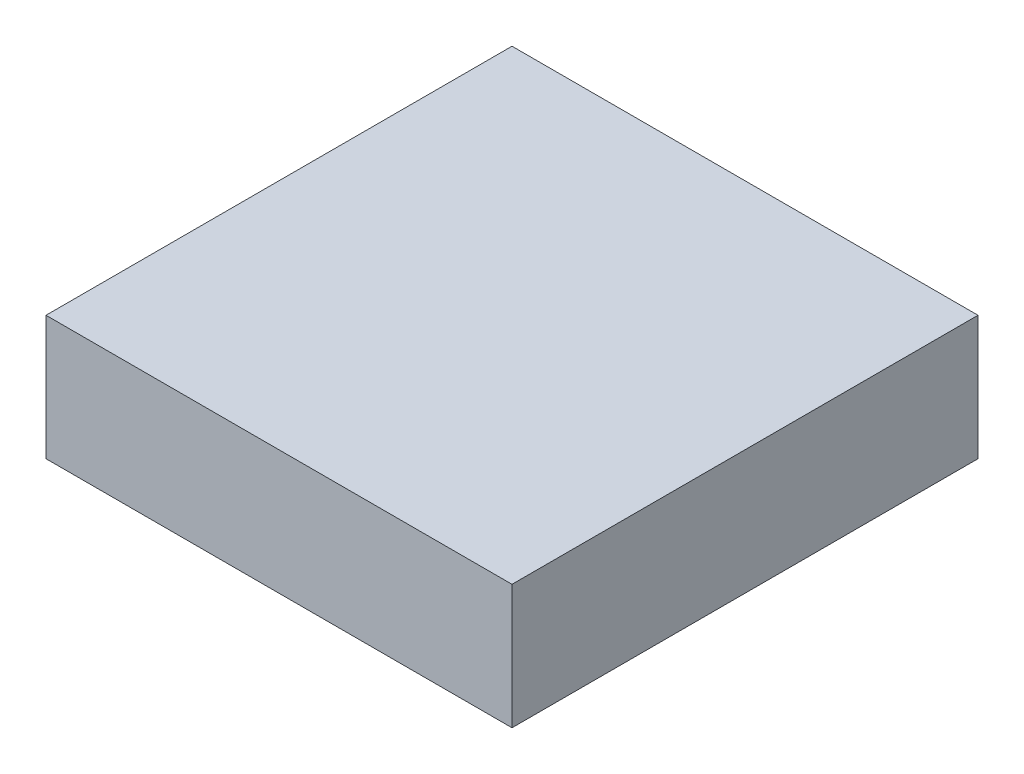
ISO-10303-21;
HEADER;
FILE_DESCRIPTION(('STEP AP214'),'2;1');
FILE_NAME('part.step','',(''),(''),'','','');
FILE_SCHEMA(('AUTOMOTIVE_DESIGN { 1 0 10303 214 1 1 1 1 }'));
ENDSEC;
DATA;
#1=APPLICATION_CONTEXT('core data for automotive mechanical design processes');
#2=APPLICATION_PROTOCOL_DEFINITION('international standard','automotive_design',2000,#1);
#3=PRODUCT_CONTEXT('',#1,'mechanical');
#4=PRODUCT('Part','Part','',(#3));
#5=PRODUCT_RELATED_PRODUCT_CATEGORY('part','',(#4));
#6=PRODUCT_DEFINITION_FORMATION('','',#4);
#7=PRODUCT_DEFINITION_CONTEXT('part definition',#1,'design');
#8=PRODUCT_DEFINITION('design','',#6,#7);
#9=PRODUCT_DEFINITION_SHAPE('','',#8);
#10=(LENGTH_UNIT() NAMED_UNIT(*) SI_UNIT(.MILLI.,.METRE.));
#11=(NAMED_UNIT(*) PLANE_ANGLE_UNIT() SI_UNIT($,.RADIAN.));
#12=(NAMED_UNIT(*) SI_UNIT($,.STERADIAN.) SOLID_ANGLE_UNIT());
#13=UNCERTAINTY_MEASURE_WITH_UNIT(LENGTH_MEASURE(1.E-05),#10,'distance_accuracy_value','');
#14=(GEOMETRIC_REPRESENTATION_CONTEXT(3) GLOBAL_UNCERTAINTY_ASSIGNED_CONTEXT((#13)) GLOBAL_UNIT_ASSIGNED_CONTEXT((#10,
#11,#12)) REPRESENTATION_CONTEXT('',''));
#15=CARTESIAN_POINT('',(0.,0.,0.));
#16=DIRECTION('',(0.,0.,1.));
#17=DIRECTION('',(1.,0.,0.));
#18=AXIS2_PLACEMENT_3D('',#15,#16,#17);
#19=CARTESIAN_POINT('',(-38.1,20.3199999999999,-38.1));
#20=DIRECTION('',(0.,0.,-1.));
#21=DIRECTION('',(-1.,0.,0.));
#22=AXIS2_PLACEMENT_3D('',#19,#20,#21);
#23=PLANE('',#22);
#24=DIRECTION('',(1.,0.,0.));
#25=VECTOR('',#24,1.);
#26=CARTESIAN_POINT('',(-38.1,0.,-38.1));
#27=LINE('',#26,#25);
#28=CARTESIAN_POINT('',(-38.1,0.,-38.1));
#29=VERTEX_POINT('',#28);
#30=CARTESIAN_POINT('',(38.1,0.,-38.1));
#31=VERTEX_POINT('',#30);
#32=EDGE_CURVE('E161',#29,#31,#27,.T.);
#33=ORIENTED_EDGE('',*,*,#32,.F.);
#34=DIRECTION('',(0.,-1.,0.));
#35=VECTOR('',#34,1.);
#36=CARTESIAN_POINT('',(-38.1,20.3199999999999,-38.1));
#37=LINE('',#36,#35);
#38=CARTESIAN_POINT('',(-38.1,20.3199999999999,-38.1));
#39=VERTEX_POINT('',#38);
#40=EDGE_CURVE('E104',#39,#29,#37,.T.);
#41=ORIENTED_EDGE('',*,*,#40,.F.);
#42=DIRECTION('',(1.,0.,0.));
#43=VECTOR('',#42,1.);
#44=CARTESIAN_POINT('',(-38.1,20.3199999999999,-38.1));
#45=LINE('',#44,#43);
#46=CARTESIAN_POINT('',(38.1,20.3199999999999,-38.1));
#47=VERTEX_POINT('',#46);
#48=EDGE_CURVE('E154',#39,#47,#45,.T.);
#49=ORIENTED_EDGE('',*,*,#48,.T.);
#50=DIRECTION('',(0.,-1.,0.));
#51=VECTOR('',#50,1.);
#52=CARTESIAN_POINT('',(38.1,20.3199999999999,-38.1));
#53=LINE('',#52,#51);
#54=EDGE_CURVE('E129',#47,#31,#53,.T.);
#55=ORIENTED_EDGE('',*,*,#54,.T.);
#56=EDGE_LOOP('',(#33,#41,#49,#55));
#57=FACE_BOUND('',#56,.T.);
#58=ADVANCED_FACE('F46',(#57),#23,.T.);
#59=CARTESIAN_POINT('',(-38.1,20.3199999999999,-38.1));
#60=DIRECTION('',(1.,0.,0.));
#61=DIRECTION('',(0.,0.,-1.));
#62=AXIS2_PLACEMENT_3D('',#59,#60,#61);
#63=PLANE('',#62);
#64=DIRECTION('',(0.,0.,1.));
#65=VECTOR('',#64,1.);
#66=CARTESIAN_POINT('',(-38.1,0.,-38.1));
#67=LINE('',#66,#65);
#68=CARTESIAN_POINT('',(-38.1,0.,38.1));
#69=VERTEX_POINT('',#68);
#70=EDGE_CURVE('E121',#29,#69,#67,.T.);
#71=ORIENTED_EDGE('',*,*,#70,.T.);
#72=DIRECTION('',(0.,-1.,0.));
#73=VECTOR('',#72,1.);
#74=CARTESIAN_POINT('',(-38.1,20.3199999999999,38.1));
#75=LINE('',#74,#73);
#76=CARTESIAN_POINT('',(-38.1,20.3199999999999,38.1));
#77=VERTEX_POINT('',#76);
#78=EDGE_CURVE('E150',#77,#69,#75,.T.);
#79=ORIENTED_EDGE('',*,*,#78,.F.);
#80=DIRECTION('',(0.,0.,1.));
#81=VECTOR('',#80,1.);
#82=CARTESIAN_POINT('',(-38.1,20.3199999999999,-38.1));
#83=LINE('',#82,#81);
#84=EDGE_CURVE('E139',#39,#77,#83,.T.);
#85=ORIENTED_EDGE('',*,*,#84,.F.);
#86=ORIENTED_EDGE('',*,*,#40,.T.);
#87=EDGE_LOOP('',(#71,#79,#85,#86));
#88=FACE_BOUND('',#87,.T.);
#89=ADVANCED_FACE('F307',(#88),#63,.F.);
#90=CARTESIAN_POINT('',(-38.1,20.3199999999999,38.1));
#91=DIRECTION('',(0.,0.,-1.));
#92=DIRECTION('',(-1.,0.,0.));
#93=AXIS2_PLACEMENT_3D('',#90,#91,#92);
#94=PLANE('',#93);
#95=DIRECTION('',(1.,0.,0.));
#96=VECTOR('',#95,1.);
#97=CARTESIAN_POINT('',(-38.1,0.,38.1));
#98=LINE('',#97,#96);
#99=CARTESIAN_POINT('',(38.1,0.,38.1));
#100=VERTEX_POINT('',#99);
#101=EDGE_CURVE('E147',#69,#100,#98,.T.);
#102=ORIENTED_EDGE('',*,*,#101,.T.);
#103=DIRECTION('',(0.,-1.,0.));
#104=VECTOR('',#103,1.);
#105=CARTESIAN_POINT('',(38.1,20.3199999999999,38.1));
#106=LINE('',#105,#104);
#107=CARTESIAN_POINT('',(38.1,20.3199999999999,38.1));
#108=VERTEX_POINT('',#107);
#109=EDGE_CURVE('E144',#108,#100,#106,.T.);
#110=ORIENTED_EDGE('',*,*,#109,.F.);
#111=DIRECTION('',(1.,0.,0.));
#112=VECTOR('',#111,1.);
#113=CARTESIAN_POINT('',(-38.1,20.3199999999999,38.1));
#114=LINE('',#113,#112);
#115=EDGE_CURVE('E134',#77,#108,#114,.T.);
#116=ORIENTED_EDGE('',*,*,#115,.F.);
#117=ORIENTED_EDGE('',*,*,#78,.T.);
#118=EDGE_LOOP('',(#102,#110,#116,#117));
#119=FACE_BOUND('',#118,.T.);
#120=ADVANCED_FACE('F145',(#119),#94,.F.);
#121=CARTESIAN_POINT('',(38.1,20.3199999999999,-38.1));
#122=DIRECTION('',(1.,0.,0.));
#123=DIRECTION('',(0.,0.,-1.));
#124=AXIS2_PLACEMENT_3D('',#121,#122,#123);
#125=PLANE('',#124);
#126=DIRECTION('',(0.,0.,1.));
#127=VECTOR('',#126,1.);
#128=CARTESIAN_POINT('',(38.1,0.,-38.1));
#129=LINE('',#128,#127);
#130=EDGE_CURVE('E165',#31,#100,#129,.T.);
#131=ORIENTED_EDGE('',*,*,#130,.F.);
#132=ORIENTED_EDGE('',*,*,#54,.F.);
#133=DIRECTION('',(0.,0.,1.));
#134=VECTOR('',#133,1.);
#135=CARTESIAN_POINT('',(38.1,20.3199999999999,-38.1));
#136=LINE('',#135,#134);
#137=EDGE_CURVE('E138',#47,#108,#136,.T.);
#138=ORIENTED_EDGE('',*,*,#137,.T.);
#139=ORIENTED_EDGE('',*,*,#109,.T.);
#140=EDGE_LOOP('',(#131,#132,#138,#139));
#141=FACE_BOUND('',#140,.T.);
#142=ADVANCED_FACE('F152',(#141),#125,.T.);
#143=CARTESIAN_POINT('',(0.,20.3199999999999,0.));
#144=DIRECTION('',(0.,-1.,0.));
#145=DIRECTION('',(0.,0.,-1.));
#146=AXIS2_PLACEMENT_3D('',#143,#144,#145);
#147=PLANE('',#146);
#148=ORIENTED_EDGE('',*,*,#48,.F.);
#149=ORIENTED_EDGE('',*,*,#84,.T.);
#150=ORIENTED_EDGE('',*,*,#115,.T.);
#151=ORIENTED_EDGE('',*,*,#137,.F.);
#152=EDGE_LOOP('',(#148,#149,#150,#151));
#153=FACE_BOUND('',#152,.T.);
#154=ADVANCED_FACE('F137',(#153),#147,.F.);
#155=CARTESIAN_POINT('',(0.,0.,0.));
#156=DIRECTION('',(0.,-1.,0.));
#157=DIRECTION('',(0.,0.,-1.));
#158=AXIS2_PLACEMENT_3D('',#155,#156,#157);
#159=PLANE('',#158);
#160=ORIENTED_EDGE('',*,*,#32,.T.);
#161=ORIENTED_EDGE('',*,*,#130,.T.);
#162=ORIENTED_EDGE('',*,*,#101,.F.);
#163=ORIENTED_EDGE('',*,*,#70,.F.);
#164=EDGE_LOOP('',(#160,#161,#162,#163));
#165=FACE_BOUND('',#164,.T.);
#166=ADVANCED_FACE('F276',(#165),#159,.T.);
#167=CLOSED_SHELL('',(#58,#89,#120,#142,#154,#166));
#168=CARTESIAN_POINT('',(-38.1,20.3199999999999,-35.56));
#169=DIRECTION('',(0.,0.,-1.));
#170=DIRECTION('',(-1.,0.,0.));
#171=AXIS2_PLACEMENT_3D('',#168,#169,#170);
#172=PLANE('',#171);
#173=DIRECTION('',(1.,0.,0.));
#174=VECTOR('',#173,1.);
#175=CARTESIAN_POINT('',(0.,2.54,-35.56));
#176=LINE('',#175,#174);
#177=CARTESIAN_POINT('',(-35.56,2.54,-35.56));
#178=VERTEX_POINT('',#177);
#179=CARTESIAN_POINT('',(35.56,2.54,-35.56));
#180=VERTEX_POINT('',#179);
#181=EDGE_CURVE('E58',#178,#180,#176,.T.);
#182=ORIENTED_EDGE('',*,*,#181,.T.);
#183=DIRECTION('',(0.,-1.,0.));
#184=VECTOR('',#183,1.);
#185=CARTESIAN_POINT('',(35.56,20.3199999999999,-35.56));
#186=LINE('',#185,#184);
#187=CARTESIAN_POINT('',(35.56,17.7799999999999,-35.56));
#188=VERTEX_POINT('',#187);
#189=EDGE_CURVE('E89',#188,#180,#186,.T.);
#190=ORIENTED_EDGE('',*,*,#189,.F.);
#191=DIRECTION('',(1.,0.,0.));
#192=VECTOR('',#191,1.);
#193=CARTESIAN_POINT('',(0.,17.7799999999999,-35.56));
#194=LINE('',#193,#192);
#195=CARTESIAN_POINT('',(-35.56,17.7799999999999,-35.56));
#196=VERTEX_POINT('',#195);
#197=EDGE_CURVE('E50',#196,#188,#194,.T.);
#198=ORIENTED_EDGE('',*,*,#197,.F.);
#199=DIRECTION('',(0.,-1.,0.));
#200=VECTOR('',#199,1.);
#201=CARTESIAN_POINT('',(-35.56,20.3199999999999,-35.56));
#202=LINE('',#201,#200);
#203=EDGE_CURVE('E95',#196,#178,#202,.T.);
#204=ORIENTED_EDGE('',*,*,#203,.T.);
#205=EDGE_LOOP('',(#182,#190,#198,#204));
#206=FACE_BOUND('',#205,.T.);
#207=ADVANCED_FACE('F212',(#206),#172,.F.);
#208=CARTESIAN_POINT('',(-35.56,20.3199999999999,-38.1));
#209=DIRECTION('',(1.,0.,0.));
#210=DIRECTION('',(0.,0.,-1.));
#211=AXIS2_PLACEMENT_3D('',#208,#209,#210);
#212=PLANE('',#211);
#213=DIRECTION('',(0.,0.,1.));
#214=VECTOR('',#213,1.);
#215=CARTESIAN_POINT('',(-35.56,2.54,0.));
#216=LINE('',#215,#214);
#217=CARTESIAN_POINT('',(-35.56,2.54,35.56));
#218=VERTEX_POINT('',#217);
#219=EDGE_CURVE('E203',#178,#218,#216,.T.);
#220=ORIENTED_EDGE('',*,*,#219,.F.);
#221=ORIENTED_EDGE('',*,*,#203,.F.);
#222=DIRECTION('',(0.,0.,1.));
#223=VECTOR('',#222,1.);
#224=CARTESIAN_POINT('',(-35.56,17.7799999999999,0.));
#225=LINE('',#224,#223);
#226=CARTESIAN_POINT('',(-35.56,17.7799999999999,35.56));
#227=VERTEX_POINT('',#226);
#228=EDGE_CURVE('E183',#196,#227,#225,.T.);
#229=ORIENTED_EDGE('',*,*,#228,.T.);
#230=DIRECTION('',(0.,-1.,0.));
#231=VECTOR('',#230,1.);
#232=CARTESIAN_POINT('',(-35.56,20.3199999999999,35.56));
#233=LINE('',#232,#231);
#234=EDGE_CURVE('E193',#227,#218,#233,.T.);
#235=ORIENTED_EDGE('',*,*,#234,.T.);
#236=EDGE_LOOP('',(#220,#221,#229,#235));
#237=FACE_BOUND('',#236,.T.);
#238=ADVANCED_FACE('F218',(#237),#212,.T.);
#239=CARTESIAN_POINT('',(-38.1,20.3199999999999,35.56));
#240=DIRECTION('',(0.,0.,-1.));
#241=DIRECTION('',(-1.,0.,0.));
#242=AXIS2_PLACEMENT_3D('',#239,#240,#241);
#243=PLANE('',#242);
#244=DIRECTION('',(1.,0.,0.));
#245=VECTOR('',#244,1.);
#246=CARTESIAN_POINT('',(0.,2.54,35.56));
#247=LINE('',#246,#245);
#248=CARTESIAN_POINT('',(35.56,2.54,35.56));
#249=VERTEX_POINT('',#248);
#250=EDGE_CURVE('E197',#218,#249,#247,.T.);
#251=ORIENTED_EDGE('',*,*,#250,.F.);
#252=ORIENTED_EDGE('',*,*,#234,.F.);
#253=DIRECTION('',(1.,0.,0.));
#254=VECTOR('',#253,1.);
#255=CARTESIAN_POINT('',(0.,17.7799999999999,35.56));
#256=LINE('',#255,#254);
#257=CARTESIAN_POINT('',(35.56,17.7799999999999,35.56));
#258=VERTEX_POINT('',#257);
#259=EDGE_CURVE('E67',#227,#258,#256,.T.);
#260=ORIENTED_EDGE('',*,*,#259,.T.);
#261=DIRECTION('',(0.,-1.,0.));
#262=VECTOR('',#261,1.);
#263=CARTESIAN_POINT('',(35.56,20.3199999999999,35.56));
#264=LINE('',#263,#262);
#265=EDGE_CURVE('E186',#258,#249,#264,.T.);
#266=ORIENTED_EDGE('',*,*,#265,.T.);
#267=EDGE_LOOP('',(#251,#252,#260,#266));
#268=FACE_BOUND('',#267,.T.);
#269=ADVANCED_FACE('F216',(#268),#243,.T.);
#270=CARTESIAN_POINT('',(35.56,20.3199999999999,-38.1));
#271=DIRECTION('',(1.,0.,0.));
#272=DIRECTION('',(0.,0.,-1.));
#273=AXIS2_PLACEMENT_3D('',#270,#271,#272);
#274=PLANE('',#273);
#275=DIRECTION('',(0.,0.,1.));
#276=VECTOR('',#275,1.);
#277=CARTESIAN_POINT('',(35.56,2.54,0.));
#278=LINE('',#277,#276);
#279=EDGE_CURVE('E11',#180,#249,#278,.T.);
#280=ORIENTED_EDGE('',*,*,#279,.T.);
#281=ORIENTED_EDGE('',*,*,#265,.F.);
#282=DIRECTION('',(0.,0.,1.));
#283=VECTOR('',#282,1.);
#284=CARTESIAN_POINT('',(35.56,17.7799999999999,0.));
#285=LINE('',#284,#283);
#286=EDGE_CURVE('E189',#188,#258,#285,.T.);
#287=ORIENTED_EDGE('',*,*,#286,.F.);
#288=ORIENTED_EDGE('',*,*,#189,.T.);
#289=EDGE_LOOP('',(#280,#281,#287,#288));
#290=FACE_BOUND('',#289,.T.);
#291=ADVANCED_FACE('F214',(#290),#274,.F.);
#292=CARTESIAN_POINT('',(0.,17.7799999999999,0.));
#293=DIRECTION('',(0.,-1.,0.));
#294=DIRECTION('',(0.,0.,-1.));
#295=AXIS2_PLACEMENT_3D('',#292,#293,#294);
#296=PLANE('',#295);
#297=ORIENTED_EDGE('',*,*,#197,.T.);
#298=ORIENTED_EDGE('',*,*,#286,.T.);
#299=ORIENTED_EDGE('',*,*,#259,.F.);
#300=ORIENTED_EDGE('',*,*,#228,.F.);
#301=EDGE_LOOP('',(#297,#298,#299,#300));
#302=FACE_BOUND('',#301,.T.);
#303=ADVANCED_FACE('F210',(#302),#296,.T.);
#304=CARTESIAN_POINT('',(0.,2.54,0.));
#305=DIRECTION('',(0.,-1.,0.));
#306=DIRECTION('',(0.,0.,-1.));
#307=AXIS2_PLACEMENT_3D('',#304,#305,#306);
#308=PLANE('',#307);
#309=ORIENTED_EDGE('',*,*,#181,.F.);
#310=ORIENTED_EDGE('',*,*,#219,.T.);
#311=ORIENTED_EDGE('',*,*,#250,.T.);
#312=ORIENTED_EDGE('',*,*,#279,.F.);
#313=EDGE_LOOP('',(#309,#310,#311,#312));
#314=FACE_BOUND('',#313,.T.);
#315=ADVANCED_FACE('F48',(#314),#308,.F.);
#316=CLOSED_SHELL('',(#207,#238,#269,#291,#303,#315));
#317=ORIENTED_CLOSED_SHELL('',*,#316,.T.);
#318=BREP_WITH_VOIDS('B2',#167,(#317));
#319=ADVANCED_BREP_SHAPE_REPRESENTATION('',(#18,#318),#14);
#320=SHAPE_DEFINITION_REPRESENTATION(#9,#319);
ENDSEC;
END-ISO-10303-21;
